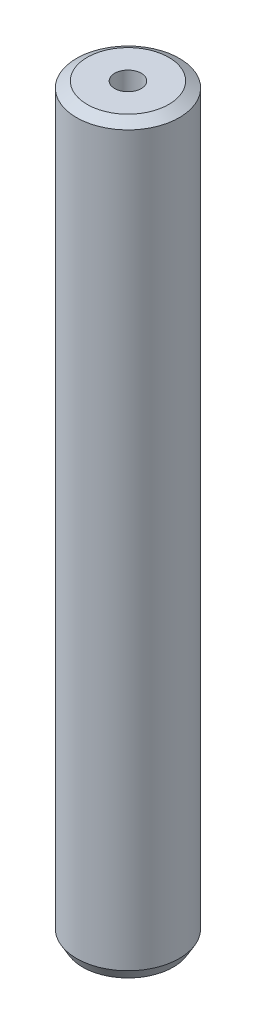
ISO-10303-21;
HEADER;
FILE_DESCRIPTION(('STEP AP214'),'2;1');
FILE_NAME('part.step','',(''),(''),'','','');
FILE_SCHEMA(('AUTOMOTIVE_DESIGN { 1 0 10303 214 1 1 1 1 }'));
ENDSEC;
DATA;
#1=APPLICATION_CONTEXT('core data for automotive mechanical design processes');
#2=APPLICATION_PROTOCOL_DEFINITION('international standard','automotive_design',2000,#1);
#3=PRODUCT_CONTEXT('',#1,'mechanical');
#4=PRODUCT('Part','Part','',(#3));
#5=PRODUCT_RELATED_PRODUCT_CATEGORY('part','',(#4));
#6=PRODUCT_DEFINITION_FORMATION('','',#4);
#7=PRODUCT_DEFINITION_CONTEXT('part definition',#1,'design');
#8=PRODUCT_DEFINITION('design','',#6,#7);
#9=PRODUCT_DEFINITION_SHAPE('','',#8);
#10=(LENGTH_UNIT() NAMED_UNIT(*) SI_UNIT(.MILLI.,.METRE.));
#11=(NAMED_UNIT(*) PLANE_ANGLE_UNIT() SI_UNIT($,.RADIAN.));
#12=(NAMED_UNIT(*) SI_UNIT($,.STERADIAN.) SOLID_ANGLE_UNIT());
#13=UNCERTAINTY_MEASURE_WITH_UNIT(LENGTH_MEASURE(1.E-05),#10,'distance_accuracy_value','');
#14=(GEOMETRIC_REPRESENTATION_CONTEXT(3) GLOBAL_UNCERTAINTY_ASSIGNED_CONTEXT((#13)) GLOBAL_UNIT_ASSIGNED_CONTEXT((#10,
#11,#12)) REPRESENTATION_CONTEXT('',''));
#15=CARTESIAN_POINT('',(0.,0.,0.));
#16=DIRECTION('',(0.,0.,1.));
#17=DIRECTION('',(1.,0.,0.));
#18=AXIS2_PLACEMENT_3D('',#15,#16,#17);
#19=CARTESIAN_POINT('',(0.,181.160194392681,0.));
#20=DIRECTION('',(0.,-1.,0.));
#21=DIRECTION('',(0.,0.,-1.));
#22=AXIS2_PLACEMENT_3D('',#19,#20,#21);
#23=CYLINDRICAL_SURFACE('',#22,12.5);
#24=CARTESIAN_POINT('',(0.,179.671737944237,0.));
#25=DIRECTION('',(0.,1.,0.));
#26=DIRECTION('',(0.,0.,1.));
#27=AXIS2_PLACEMENT_3D('',#24,#25,#26);
#28=CIRCLE('',#27,12.5);
#29=CARTESIAN_POINT('',(0.,179.671737944237,12.5));
#30=VERTEX_POINT('',#29);
#31=EDGE_CURVE('E50',#30,#30,#28,.F.);
#32=ORIENTED_EDGE('',*,*,#31,.T.);
#33=EDGE_LOOP('',(#32));
#34=FACE_BOUND('',#33,.T.);
#35=CARTESIAN_POINT('',(0.,2.57808219355785,0.));
#36=DIRECTION('',(0.,1.,0.));
#37=DIRECTION('',(0.,0.,1.));
#38=AXIS2_PLACEMENT_3D('',#35,#36,#37);
#39=CIRCLE('',#38,12.5);
#40=CARTESIAN_POINT('',(0.,2.57808219355785,12.5));
#41=VERTEX_POINT('',#40);
#42=EDGE_CURVE('E51',#41,#41,#39,.T.);
#43=ORIENTED_EDGE('',*,*,#42,.T.);
#44=EDGE_LOOP('',(#43));
#45=FACE_BOUND('',#44,.T.);
#46=ADVANCED_FACE('F39',(#34,#45),#23,.T.);
#47=CARTESIAN_POINT('',(0.,181.160194392681,0.));
#48=DIRECTION('',(0.,1.,0.));
#49=DIRECTION('',(0.,0.,1.));
#50=AXIS2_PLACEMENT_3D('',#47,#48,#49);
#51=PLANE('',#50);
#52=CARTESIAN_POINT('',(0.,181.160194392681,0.));
#53=DIRECTION('',(0.,1.,0.));
#54=DIRECTION('',(0.,0.,1.));
#55=AXIS2_PLACEMENT_3D('',#52,#53,#54);
#56=CIRCLE('',#55,9.92191780644206);
#57=CARTESIAN_POINT('',(0.,181.160194392681,9.92191780644206));
#58=VERTEX_POINT('',#57);
#59=EDGE_CURVE('E54',#58,#58,#56,.T.);
#60=ORIENTED_EDGE('',*,*,#59,.T.);
#61=EDGE_LOOP('',(#60));
#62=FACE_BOUND('',#61,.T.);
#63=CARTESIAN_POINT('',(0.,181.160194392681,0.));
#64=DIRECTION('',(0.,1.,0.));
#65=DIRECTION('',(0.,0.,1.));
#66=AXIS2_PLACEMENT_3D('',#63,#64,#65);
#67=CIRCLE('',#66,3.23381897942672);
#68=CARTESIAN_POINT('',(0.,181.160194392681,3.23381897942672));
#69=VERTEX_POINT('',#68);
#70=EDGE_CURVE('E58',#69,#69,#67,.T.);
#71=ORIENTED_EDGE('',*,*,#70,.F.);
#72=EDGE_LOOP('',(#71));
#73=FACE_BOUND('',#72,.T.);
#74=ADVANCED_FACE('F69',(#62,#73),#51,.T.);
#75=CARTESIAN_POINT('',(0.,0.,0.));
#76=DIRECTION('',(0.,1.,0.));
#77=DIRECTION('',(0.,0.,1.));
#78=AXIS2_PLACEMENT_3D('',#75,#76,#77);
#79=PLANE('',#78);
#80=CARTESIAN_POINT('',(0.,0.,0.));
#81=DIRECTION('',(0.,1.,0.));
#82=DIRECTION('',(0.,0.,1.));
#83=AXIS2_PLACEMENT_3D('',#80,#81,#82);
#84=CIRCLE('',#83,11.0115435515564);
#85=CARTESIAN_POINT('',(0.,0.,11.0115435515564));
#86=VERTEX_POINT('',#85);
#87=EDGE_CURVE('E10',#86,#86,#84,.F.);
#88=ORIENTED_EDGE('',*,*,#87,.T.);
#89=EDGE_LOOP('',(#88));
#90=FACE_BOUND('',#89,.T.);
#91=CARTESIAN_POINT('',(0.,0.,0.));
#92=DIRECTION('',(0.,1.,0.));
#93=DIRECTION('',(0.,0.,1.));
#94=AXIS2_PLACEMENT_3D('',#91,#92,#93);
#95=CIRCLE('',#94,3.23381897942672);
#96=CARTESIAN_POINT('',(0.,0.,3.23381897942672));
#97=VERTEX_POINT('',#96);
#98=EDGE_CURVE('E63',#97,#97,#95,.T.);
#99=ORIENTED_EDGE('',*,*,#98,.T.);
#100=EDGE_LOOP('',(#99));
#101=FACE_BOUND('',#100,.T.);
#102=ADVANCED_FACE('F75',(#90,#101),#79,.F.);
#103=CARTESIAN_POINT('',(0.,181.160194392681,0.));
#104=DIRECTION('',(0.,-1.,0.));
#105=DIRECTION('',(0.,0.,-1.));
#106=AXIS2_PLACEMENT_3D('',#103,#104,#105);
#107=CYLINDRICAL_SURFACE('',#106,3.23381897942672);
#108=ORIENTED_EDGE('',*,*,#70,.T.);
#109=EDGE_LOOP('',(#108));
#110=FACE_BOUND('',#109,.T.);
#111=ORIENTED_EDGE('',*,*,#98,.F.);
#112=EDGE_LOOP('',(#111));
#113=FACE_BOUND('',#112,.T.);
#114=ADVANCED_FACE('F70',(#110,#113),#107,.F.);
#115=CARTESIAN_POINT('',(0.,181.160194392681,0.));
#116=DIRECTION('',(0.,-1.,0.));
#117=DIRECTION('',(0.,0.,-1.));
#118=AXIS2_PLACEMENT_3D('',#115,#116,#117);
#119=CONICAL_SURFACE('',#118,9.92191780644206,1.0471975511966);
#120=ORIENTED_EDGE('',*,*,#31,.F.);
#121=EDGE_LOOP('',(#120));
#122=FACE_BOUND('',#121,.T.);
#123=ORIENTED_EDGE('',*,*,#59,.F.);
#124=EDGE_LOOP('',(#123));
#125=FACE_BOUND('',#124,.T.);
#126=ADVANCED_FACE('F81',(#122,#125),#119,.T.);
#127=CARTESIAN_POINT('',(0.,2.57808219355785,0.));
#128=DIRECTION('',(0.,1.,0.));
#129=DIRECTION('',(0.,0.,1.));
#130=AXIS2_PLACEMENT_3D('',#127,#128,#129);
#131=CONICAL_SURFACE('',#130,12.5,0.523598775598303);
#132=CARTESIAN_POINT('',(0.,0.,11.0115435515564));
#133=CARTESIAN_POINT('',(0.,0.0268550228495609,11.0270483062277));
#134=CARTESIAN_POINT('',(0.,0.0537100456991216,11.042553060899));
#135=CARTESIAN_POINT('',(0.,0.107420091398243,11.0735625702415));
#136=CARTESIAN_POINT('',(0.,0.134275114247804,11.0890673249128));
#137=CARTESIAN_POINT('',(0.,0.187985159946926,11.1200768342554));
#138=CARTESIAN_POINT('',(0.,0.214840182796487,11.1355815889267));
#139=CARTESIAN_POINT('',(0.,0.268550228495609,11.1665910982693));
#140=CARTESIAN_POINT('',(0.,0.295405251345169,11.1820958529405));
#141=CARTESIAN_POINT('',(0.,0.349115297044291,11.2131053622831));
#142=CARTESIAN_POINT('',(0.,0.375970319893852,11.2286101169544));
#143=CARTESIAN_POINT('',(0.,0.429680365592974,11.259619626297));
#144=CARTESIAN_POINT('',(0.,0.456535388442535,11.2751243809683));
#145=CARTESIAN_POINT('',(0.,0.510245434141657,11.3061338903108));
#146=CARTESIAN_POINT('',(0.,0.537100456991217,11.3216386449821));
#147=CARTESIAN_POINT('',(0.,0.590810502690339,11.3526481543247));
#148=CARTESIAN_POINT('',(0.,0.6176655255399,11.368152908996));
#149=CARTESIAN_POINT('',(0.,0.671375571239022,11.3991624183386));
#150=CARTESIAN_POINT('',(0.,0.698230594088582,11.4146671730099));
#151=CARTESIAN_POINT('',(0.,0.751940639787704,11.4456766823524));
#152=CARTESIAN_POINT('',(0.,0.778795662637265,11.4611814370237));
#153=CARTESIAN_POINT('',(0.,0.832505708336387,11.4921909463663));
#154=CARTESIAN_POINT('',(0.,0.859360731185948,11.5076957010376));
#155=CARTESIAN_POINT('',(0.,0.91307077688507,11.5387052103802));
#156=CARTESIAN_POINT('',(0.,0.939925799734631,11.5542099650515));
#157=CARTESIAN_POINT('',(0.,0.993635845433753,11.585219474394));
#158=CARTESIAN_POINT('',(0.,1.02049086828331,11.6007242290653));
#159=CARTESIAN_POINT('',(0.,1.07420091398244,11.6317337384079));
#160=CARTESIAN_POINT('',(0.,1.101055936832,11.6472384930792));
#161=CARTESIAN_POINT('',(0.,1.15476598253112,11.6782480024218));
#162=CARTESIAN_POINT('',(0.,1.18162100538068,11.693752757093));
#163=CARTESIAN_POINT('',(0.,1.2353310510798,11.7247622664356));
#164=CARTESIAN_POINT('',(0.,1.26218607392936,11.7402670211069));
#165=CARTESIAN_POINT('',(0.,1.31589611962848,11.7712765304495));
#166=CARTESIAN_POINT('',(0.,1.34275114247804,11.7867812851208));
#167=CARTESIAN_POINT('',(0.,1.39646118817717,11.8177907944633));
#168=CARTESIAN_POINT('',(0.,1.42331621102673,11.8332955491346));
#169=CARTESIAN_POINT('',(0.,1.47702625672585,11.8643050584772));
#170=CARTESIAN_POINT('',(0.,1.50388127957541,11.8798098131485));
#171=CARTESIAN_POINT('',(0.,1.55759132527453,11.9108193224911));
#172=CARTESIAN_POINT('',(0.,1.58444634812409,11.9263240771624));
#173=CARTESIAN_POINT('',(0.,1.63815639382321,11.9573335865049));
#174=CARTESIAN_POINT('',(0.,1.66501141667277,11.9728383411762));
#175=CARTESIAN_POINT('',(0.,1.7187214623719,12.0038478505188));
#176=CARTESIAN_POINT('',(0.,1.74557648522146,12.0193526051901));
#177=CARTESIAN_POINT('',(0.,1.79928653092058,12.0503621145327));
#178=CARTESIAN_POINT('',(0.,1.82614155377014,12.0658668692039));
#179=CARTESIAN_POINT('',(0.,1.87985159946926,12.0968763785465));
#180=CARTESIAN_POINT('',(0.,1.90670662231882,12.1123811332178));
#181=CARTESIAN_POINT('',(0.,1.96041666801794,12.1433906425604));
#182=CARTESIAN_POINT('',(0.,1.98727169086751,12.1588953972317));
#183=CARTESIAN_POINT('',(0.,2.04098173656663,12.1899049065742));
#184=CARTESIAN_POINT('',(0.,2.06783675941619,12.2054096612455));
#185=CARTESIAN_POINT('',(0.,2.12154680511531,12.2364191705881));
#186=CARTESIAN_POINT('',(0.,2.14840182796487,12.2519239252594));
#187=CARTESIAN_POINT('',(0.,2.20211187366399,12.282933434602));
#188=CARTESIAN_POINT('',(0.,2.22896689651355,12.2984381892733));
#189=CARTESIAN_POINT('',(0.,2.28267694221268,12.3294476986158));
#190=CARTESIAN_POINT('',(0.,2.30953196506224,12.3449524532871));
#191=CARTESIAN_POINT('',(0.,2.36324201076136,12.3759619626297));
#192=CARTESIAN_POINT('',(0.,2.39009703361092,12.391466717301));
#193=CARTESIAN_POINT('',(0.,2.44380707931004,12.4224762266436));
#194=CARTESIAN_POINT('',(0.,2.4706621021596,12.4379809813148));
#195=CARTESIAN_POINT('',(0.,2.52437214785872,12.4689904906574));
#196=CARTESIAN_POINT('',(0.,2.55122717070828,12.4844952453287));
#197=CARTESIAN_POINT('',(0.,2.57808219355785,12.5));
#198=B_SPLINE_CURVE_WITH_KNOTS('',3,(#132,#133,#134,#135,#136,#137,#138,#139,#140,#141,#142,
#143,#144,#145,#146,#147,#148,#149,#150,#151,#152,#153,#154,#155,#156,#157,#158,#159,#160,#161,
#162,#163,#164,#165,#166,#167,#168,#169,#170,#171,#172,#173,#174,#175,#176,#177,#178,#179,#180,
#181,#182,#183,#184,#185,#186,#187,#188,#189,#190,#191,#192,#193,#194,#195,#196,#197),
.UNSPECIFIED.,.F.,.F.,(4,2,2,2,2,2,2,2,2,2,2,2,2,2,2,2,2,2,2,2,2,2,2,2,2,2,2,2,2,2,2,2,4),(0.,
0.0930285280277249,0.186057056055451,0.279085584083176,0.372114112110902,0.465142640138627,
0.558171168166352,0.651199696194078,0.744228224221803,0.837256752249529,0.930285280277254,
1.02331380830498,1.1163423363327,1.20937086436043,1.30239939238816,1.39542792041588,
1.48845644844361,1.58148497647133,1.67451350449906,1.76754203252678,1.86057056055451,
1.95359908858224,2.04662761660996,2.13965614463769,2.23268467266541,2.32571320069314,
2.41874172872086,2.51177025674859,2.60479878477631,2.69782731280404,2.79085584083176,
2.88388436885949,2.97691289688722),.UNSPECIFIED.);
#199=EDGE_CURVE('BSEAM45',#86,#41,#198,.T.);
#200=ORIENTED_EDGE('',*,*,#87,.F.);
#201=ORIENTED_EDGE('',*,*,#42,.F.);
#202=ORIENTED_EDGE('',*,*,#199,.T.);
#203=ORIENTED_EDGE('',*,*,#199,.F.);
#204=EDGE_LOOP('',(#200,#202,#201,#203));
#205=FACE_BOUND('',#204,.T.);
#206=ADVANCED_FACE('F45',(#205),#131,.T.);
#207=CLOSED_SHELL('',(#46,#74,#102,#114,#126,#206));
#208=MANIFOLD_SOLID_BREP('B2',#207);
#209=ADVANCED_BREP_SHAPE_REPRESENTATION('',(#18,#208),#14);
#210=SHAPE_DEFINITION_REPRESENTATION(#9,#209);
ENDSEC;
END-ISO-10303-21;
